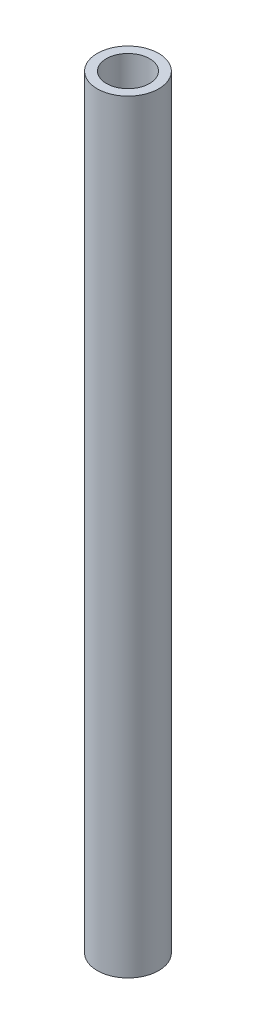
ISO-10303-21;
HEADER;
FILE_DESCRIPTION(('STEP AP214'),'2;1');
FILE_NAME('part.step','',(''),(''),'','','');
FILE_SCHEMA(('AUTOMOTIVE_DESIGN { 1 0 10303 214 1 1 1 1 }'));
ENDSEC;
DATA;
#1=APPLICATION_CONTEXT('core data for automotive mechanical design processes');
#2=APPLICATION_PROTOCOL_DEFINITION('international standard','automotive_design',2000,#1);
#3=PRODUCT_CONTEXT('',#1,'mechanical');
#4=PRODUCT('Part','Part','',(#3));
#5=PRODUCT_RELATED_PRODUCT_CATEGORY('part','',(#4));
#6=PRODUCT_DEFINITION_FORMATION('','',#4);
#7=PRODUCT_DEFINITION_CONTEXT('part definition',#1,'design');
#8=PRODUCT_DEFINITION('design','',#6,#7);
#9=PRODUCT_DEFINITION_SHAPE('','',#8);
#10=(LENGTH_UNIT() NAMED_UNIT(*) SI_UNIT(.MILLI.,.METRE.));
#11=(NAMED_UNIT(*) PLANE_ANGLE_UNIT() SI_UNIT($,.RADIAN.));
#12=(NAMED_UNIT(*) SI_UNIT($,.STERADIAN.) SOLID_ANGLE_UNIT());
#13=UNCERTAINTY_MEASURE_WITH_UNIT(LENGTH_MEASURE(1.E-05),#10,'distance_accuracy_value','');
#14=(GEOMETRIC_REPRESENTATION_CONTEXT(3) GLOBAL_UNCERTAINTY_ASSIGNED_CONTEXT((#13)) GLOBAL_UNIT_ASSIGNED_CONTEXT((#10,
#11,#12)) REPRESENTATION_CONTEXT('',''));
#15=CARTESIAN_POINT('',(0.,0.,0.));
#16=DIRECTION('',(0.,0.,1.));
#17=DIRECTION('',(1.,0.,0.));
#18=AXIS2_PLACEMENT_3D('',#15,#16,#17);
#19=CARTESIAN_POINT('',(0.,460.,0.));
#20=DIRECTION('',(0.,1.,0.));
#21=DIRECTION('',(0.,0.,1.));
#22=AXIS2_PLACEMENT_3D('',#19,#20,#21);
#23=PLANE('',#22);
#24=CARTESIAN_POINT('',(0.,460.,0.));
#25=DIRECTION('',(0.,1.,0.));
#26=DIRECTION('',(0.,0.,1.));
#27=AXIS2_PLACEMENT_3D('',#24,#25,#26);
#28=CIRCLE('',#27,18.5);
#29=CARTESIAN_POINT('',(0.,460.,18.5));
#30=VERTEX_POINT('',#29);
#31=EDGE_CURVE('E10',#30,#30,#28,.T.);
#32=ORIENTED_EDGE('',*,*,#31,.T.);
#33=EDGE_LOOP('',(#32));
#34=FACE_BOUND('',#33,.T.);
#35=CARTESIAN_POINT('',(0.,460.,0.));
#36=DIRECTION('',(0.,1.,0.));
#37=DIRECTION('',(0.,0.,1.));
#38=AXIS2_PLACEMENT_3D('',#35,#36,#37);
#39=CIRCLE('',#38,13.);
#40=CARTESIAN_POINT('',(0.,460.,13.));
#41=VERTEX_POINT('',#40);
#42=EDGE_CURVE('E46',#41,#41,#39,.T.);
#43=ORIENTED_EDGE('',*,*,#42,.F.);
#44=EDGE_LOOP('',(#43));
#45=FACE_BOUND('',#44,.T.);
#46=ADVANCED_FACE('F35',(#34,#45),#23,.T.);
#47=CARTESIAN_POINT('',(0.,0.,0.));
#48=DIRECTION('',(0.,1.,0.));
#49=DIRECTION('',(0.,0.,1.));
#50=AXIS2_PLACEMENT_3D('',#47,#48,#49);
#51=PLANE('',#50);
#52=CARTESIAN_POINT('',(0.,0.,0.));
#53=DIRECTION('',(0.,1.,0.));
#54=DIRECTION('',(0.,0.,1.));
#55=AXIS2_PLACEMENT_3D('',#52,#53,#54);
#56=CIRCLE('',#55,18.5);
#57=CARTESIAN_POINT('',(0.,0.,18.5));
#58=VERTEX_POINT('',#57);
#59=EDGE_CURVE('E39',#58,#58,#56,.T.);
#60=ORIENTED_EDGE('',*,*,#59,.F.);
#61=EDGE_LOOP('',(#60));
#62=FACE_BOUND('',#61,.T.);
#63=CARTESIAN_POINT('',(0.,0.,0.));
#64=DIRECTION('',(0.,1.,0.));
#65=DIRECTION('',(0.,0.,1.));
#66=AXIS2_PLACEMENT_3D('',#63,#64,#65);
#67=CIRCLE('',#66,13.);
#68=CARTESIAN_POINT('',(0.,0.,13.));
#69=VERTEX_POINT('',#68);
#70=EDGE_CURVE('E48',#69,#69,#67,.T.);
#71=ORIENTED_EDGE('',*,*,#70,.T.);
#72=EDGE_LOOP('',(#71));
#73=FACE_BOUND('',#72,.T.);
#74=ADVANCED_FACE('F58',(#62,#73),#51,.F.);
#75=CARTESIAN_POINT('',(0.,460.,0.));
#76=DIRECTION('',(0.,-1.,0.));
#77=DIRECTION('',(0.,0.,-1.));
#78=AXIS2_PLACEMENT_3D('',#75,#76,#77);
#79=CYLINDRICAL_SURFACE('',#78,18.5);
#80=ORIENTED_EDGE('',*,*,#31,.F.);
#81=EDGE_LOOP('',(#80));
#82=FACE_BOUND('',#81,.T.);
#83=ORIENTED_EDGE('',*,*,#59,.T.);
#84=EDGE_LOOP('',(#83));
#85=FACE_BOUND('',#84,.T.);
#86=ADVANCED_FACE('F37',(#82,#85),#79,.T.);
#87=CARTESIAN_POINT('',(0.,460.,0.));
#88=DIRECTION('',(0.,-1.,0.));
#89=DIRECTION('',(0.,0.,-1.));
#90=AXIS2_PLACEMENT_3D('',#87,#88,#89);
#91=CYLINDRICAL_SURFACE('',#90,13.);
#92=ORIENTED_EDGE('',*,*,#42,.T.);
#93=EDGE_LOOP('',(#92));
#94=FACE_BOUND('',#93,.T.);
#95=ORIENTED_EDGE('',*,*,#70,.F.);
#96=EDGE_LOOP('',(#95));
#97=FACE_BOUND('',#96,.T.);
#98=ADVANCED_FACE('F54',(#94,#97),#91,.F.);
#99=CLOSED_SHELL('',(#46,#74,#86,#98));
#100=MANIFOLD_SOLID_BREP('B2',#99);
#101=ADVANCED_BREP_SHAPE_REPRESENTATION('',(#18,#100),#14);
#102=SHAPE_DEFINITION_REPRESENTATION(#9,#101);
ENDSEC;
END-ISO-10303-21;
